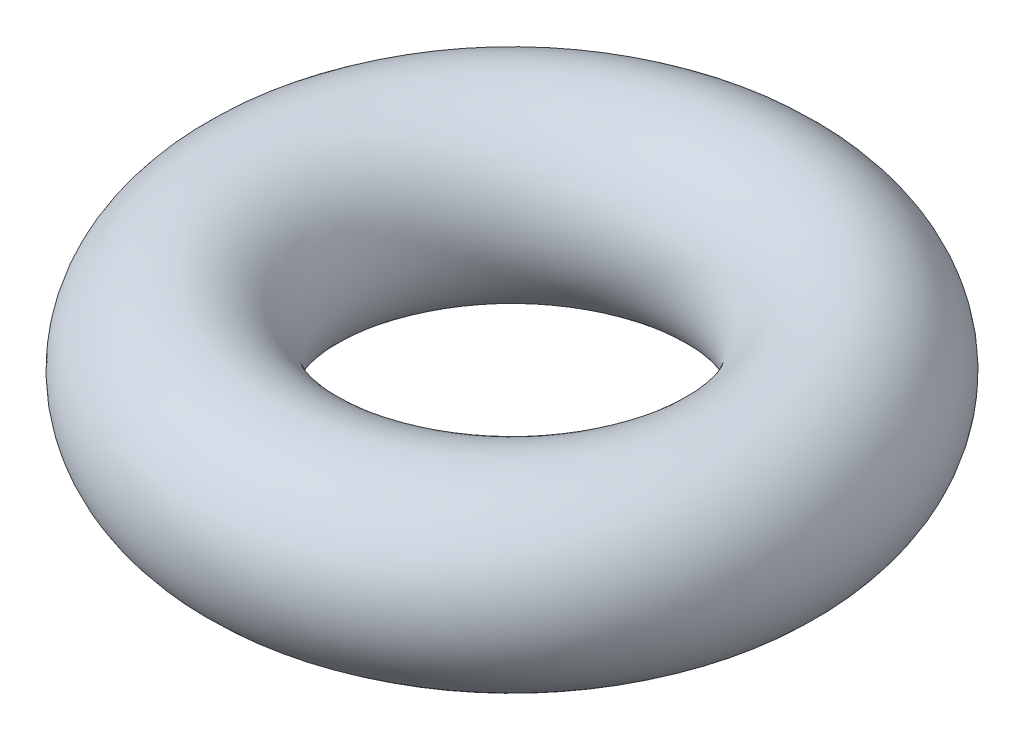
ISO-10303-21;
HEADER;
FILE_DESCRIPTION(('STEP AP214'),'2;1');
FILE_NAME('part.step','',(''),(''),'','','');
FILE_SCHEMA(('AUTOMOTIVE_DESIGN { 1 0 10303 214 1 1 1 1 }'));
ENDSEC;
DATA;
#1=APPLICATION_CONTEXT('core data for automotive mechanical design processes');
#2=APPLICATION_PROTOCOL_DEFINITION('international standard','automotive_design',2000,#1);
#3=PRODUCT_CONTEXT('',#1,'mechanical');
#4=PRODUCT('Part','Part','',(#3));
#5=PRODUCT_RELATED_PRODUCT_CATEGORY('part','',(#4));
#6=PRODUCT_DEFINITION_FORMATION('','',#4);
#7=PRODUCT_DEFINITION_CONTEXT('part definition',#1,'design');
#8=PRODUCT_DEFINITION('design','',#6,#7);
#9=PRODUCT_DEFINITION_SHAPE('','',#8);
#10=(LENGTH_UNIT() NAMED_UNIT(*) SI_UNIT(.MILLI.,.METRE.));
#11=(NAMED_UNIT(*) PLANE_ANGLE_UNIT() SI_UNIT($,.RADIAN.));
#12=(NAMED_UNIT(*) SI_UNIT($,.STERADIAN.) SOLID_ANGLE_UNIT());
#13=UNCERTAINTY_MEASURE_WITH_UNIT(LENGTH_MEASURE(1.E-05),#10,'distance_accuracy_value','');
#14=(GEOMETRIC_REPRESENTATION_CONTEXT(3) GLOBAL_UNCERTAINTY_ASSIGNED_CONTEXT((#13)) GLOBAL_UNIT_ASSIGNED_CONTEXT((#10,
#11,#12)) REPRESENTATION_CONTEXT('',''));
#15=CARTESIAN_POINT('',(0.,0.,0.));
#16=DIRECTION('',(0.,0.,1.));
#17=DIRECTION('',(1.,0.,0.));
#18=AXIS2_PLACEMENT_3D('',#15,#16,#17);
#19=CARTESIAN_POINT('',(0.,0.,0.));
#20=DIRECTION('',(0.,-1.,0.));
#21=DIRECTION('',(0.,0.,-1.));
#22=AXIS2_PLACEMENT_3D('',#19,#20,#21);
#23=TOROIDAL_SURFACE('',#22,2.3368,0.889);
#24=CARTESIAN_POINT('',(0.,0.,-3.2258));
#25=VERTEX_POINT('',#24);
#26=VERTEX_LOOP('',#25);
#27=FACE_BOUND('',#26,.T.);
#28=ADVANCED_FACE('F33',(#27),#23,.T.);
#29=CLOSED_SHELL('',(#28));
#30=MANIFOLD_SOLID_BREP('B2',#29);
#31=ADVANCED_BREP_SHAPE_REPRESENTATION('',(#18,#30),#14);
#32=SHAPE_DEFINITION_REPRESENTATION(#9,#31);
ENDSEC;
END-ISO-10303-21;
